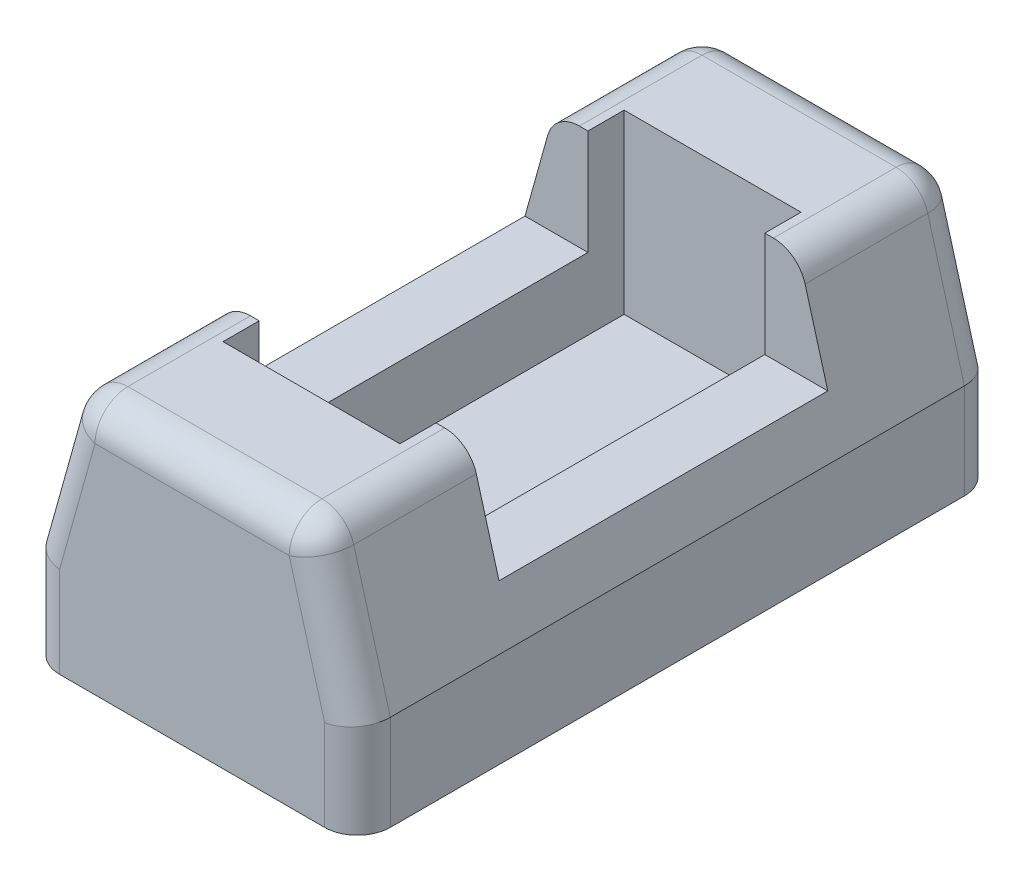
ISO-10303-21;
HEADER;
FILE_DESCRIPTION(('STEP AP214'),'2;1');
FILE_NAME('part.step','',(''),(''),'','','');
FILE_SCHEMA(('AUTOMOTIVE_DESIGN { 1 0 10303 214 1 1 1 1 }'));
ENDSEC;
DATA;
#1=APPLICATION_CONTEXT('core data for automotive mechanical design processes');
#2=APPLICATION_PROTOCOL_DEFINITION('international standard','automotive_design',2000,#1);
#3=PRODUCT_CONTEXT('',#1,'mechanical');
#4=PRODUCT('Part','Part','',(#3));
#5=PRODUCT_RELATED_PRODUCT_CATEGORY('part','',(#4));
#6=PRODUCT_DEFINITION_FORMATION('','',#4);
#7=PRODUCT_DEFINITION_CONTEXT('part definition',#1,'design');
#8=PRODUCT_DEFINITION('design','',#6,#7);
#9=PRODUCT_DEFINITION_SHAPE('','',#8);
#10=(LENGTH_UNIT() NAMED_UNIT(*) SI_UNIT(.MILLI.,.METRE.));
#11=(NAMED_UNIT(*) PLANE_ANGLE_UNIT() SI_UNIT($,.RADIAN.));
#12=(NAMED_UNIT(*) SI_UNIT($,.STERADIAN.) SOLID_ANGLE_UNIT());
#13=UNCERTAINTY_MEASURE_WITH_UNIT(LENGTH_MEASURE(1.E-05),#10,'distance_accuracy_value','');
#14=(GEOMETRIC_REPRESENTATION_CONTEXT(3) GLOBAL_UNCERTAINTY_ASSIGNED_CONTEXT((#13)) GLOBAL_UNIT_ASSIGNED_CONTEXT((#10,
#11,#12)) REPRESENTATION_CONTEXT('',''));
#15=CARTESIAN_POINT('',(0.,0.,0.));
#16=DIRECTION('',(0.,0.,1.));
#17=DIRECTION('',(1.,0.,0.));
#18=AXIS2_PLACEMENT_3D('',#15,#16,#17);
#19=CARTESIAN_POINT('',(0.,1.12,0.));
#20=DIRECTION('',(0.,1.,0.));
#21=DIRECTION('',(0.,0.,1.));
#22=AXIS2_PLACEMENT_3D('',#19,#20,#21);
#23=PLANE('',#22);
#24=DIRECTION('',(0.,0.,-1.));
#25=VECTOR('',#24,1.);
#26=CARTESIAN_POINT('',(1.345,1.12,3.05));
#27=LINE('',#26,#25);
#28=CARTESIAN_POINT('',(1.345,1.12,3.05));
#29=VERTEX_POINT('',#28);
#30=CARTESIAN_POINT('',(1.345,1.12,-3.05));
#31=VERTEX_POINT('',#30);
#32=EDGE_CURVE('E655',#29,#31,#27,.T.);
#33=ORIENTED_EDGE('',*,*,#32,.T.);
#34=DIRECTION('',(-1.,0.,0.));
#35=VECTOR('',#34,1.);
#36=CARTESIAN_POINT('',(1.345,1.12,-3.05));
#37=LINE('',#36,#35);
#38=CARTESIAN_POINT('',(-1.345,1.12,-3.05));
#39=VERTEX_POINT('',#38);
#40=EDGE_CURVE('E658',#31,#39,#37,.T.);
#41=ORIENTED_EDGE('',*,*,#40,.T.);
#42=DIRECTION('',(0.,0.,1.));
#43=VECTOR('',#42,1.);
#44=CARTESIAN_POINT('',(-1.345,1.12,3.05));
#45=LINE('',#44,#43);
#46=CARTESIAN_POINT('',(-1.345,1.12,3.05));
#47=VERTEX_POINT('',#46);
#48=EDGE_CURVE('E645',#39,#47,#45,.T.);
#49=ORIENTED_EDGE('',*,*,#48,.T.);
#50=DIRECTION('',(1.,0.,0.));
#51=VECTOR('',#50,1.);
#52=CARTESIAN_POINT('',(1.345,1.12,3.05));
#53=LINE('',#52,#51);
#54=EDGE_CURVE('E667',#47,#29,#53,.T.);
#55=ORIENTED_EDGE('',*,*,#54,.T.);
#56=EDGE_LOOP('',(#33,#41,#49,#55));
#57=FACE_BOUND('',#56,.T.);
#58=ADVANCED_FACE('F17',(#57),#23,.T.);
#59=CARTESIAN_POINT('',(1.345,1.12,-3.05));
#60=DIRECTION('',(0.,0.,-1.));
#61=DIRECTION('',(-1.,0.,0.));
#62=AXIS2_PLACEMENT_3D('',#59,#60,#61);
#63=PLANE('',#62);
#64=DIRECTION('',(0.,1.,0.));
#65=VECTOR('',#64,1.);
#66=CARTESIAN_POINT('',(-1.345,1.12,-3.05));
#67=LINE('',#66,#65);
#68=CARTESIAN_POINT('',(-1.345,3.81,-3.05));
#69=VERTEX_POINT('',#68);
#70=EDGE_CURVE('E628',#69,#39,#67,.F.);
#71=ORIENTED_EDGE('',*,*,#70,.T.);
#72=ORIENTED_EDGE('',*,*,#40,.F.);
#73=DIRECTION('',(0.,1.,0.));
#74=VECTOR('',#73,1.);
#75=CARTESIAN_POINT('',(1.345,1.12,-3.05));
#76=LINE('',#75,#74);
#77=CARTESIAN_POINT('',(1.345,3.81,-3.05));
#78=VERTEX_POINT('',#77);
#79=EDGE_CURVE('E652',#31,#78,#76,.T.);
#80=ORIENTED_EDGE('',*,*,#79,.T.);
#81=DIRECTION('',(1.,0.,0.));
#82=VECTOR('',#81,1.);
#83=CARTESIAN_POINT('',(-1.855543495359,3.81,-3.05));
#84=LINE('',#83,#82);
#85=EDGE_CURVE('E631',#78,#69,#84,.F.);
#86=ORIENTED_EDGE('',*,*,#85,.T.);
#87=EDGE_LOOP('',(#71,#72,#80,#86));
#88=FACE_BOUND('',#87,.T.);
#89=ADVANCED_FACE('F423',(#88),#63,.F.);
#90=CARTESIAN_POINT('',(-1.345,1.12,3.05));
#91=DIRECTION('',(-1.,0.,0.));
#92=DIRECTION('',(0.,0.,1.));
#93=AXIS2_PLACEMENT_3D('',#90,#91,#92);
#94=PLANE('',#93);
#95=DIRECTION('',(0.,1.,0.));
#96=VECTOR('',#95,1.);
#97=CARTESIAN_POINT('',(-1.345,1.12,3.05));
#98=LINE('',#97,#96);
#99=CARTESIAN_POINT('',(-1.345,3.81,3.05));
#100=VERTEX_POINT('',#99);
#101=EDGE_CURVE('E669',#100,#47,#98,.F.);
#102=ORIENTED_EDGE('',*,*,#101,.T.);
#103=ORIENTED_EDGE('',*,*,#48,.F.);
#104=ORIENTED_EDGE('',*,*,#70,.F.);
#105=DIRECTION('',(0.,0.,-1.));
#106=VECTOR('',#105,1.);
#107=CARTESIAN_POINT('',(-1.345,3.81,4.865));
#108=LINE('',#107,#106);
#109=CARTESIAN_POINT('',(-1.345,3.81,-2.5));
#110=VERTEX_POINT('',#109);
#111=EDGE_CURVE('E625',#69,#110,#108,.F.);
#112=ORIENTED_EDGE('',*,*,#111,.T.);
#113=DIRECTION('',(0.,1.,0.));
#114=VECTOR('',#113,1.);
#115=CARTESIAN_POINT('',(-1.345,3.81,-2.5));
#116=LINE('',#115,#114);
#117=CARTESIAN_POINT('',(-1.345,2.21,-2.5));
#118=VERTEX_POINT('',#117);
#119=EDGE_CURVE('E389',#110,#118,#116,.F.);
#120=ORIENTED_EDGE('',*,*,#119,.T.);
#121=DIRECTION('',(0.,0.,-1.));
#122=VECTOR('',#121,1.);
#123=CARTESIAN_POINT('',(-1.345,2.21,2.5));
#124=LINE('',#123,#122);
#125=CARTESIAN_POINT('',(-1.345,2.21,2.5));
#126=VERTEX_POINT('',#125);
#127=EDGE_CURVE('E367',#118,#126,#124,.F.);
#128=ORIENTED_EDGE('',*,*,#127,.T.);
#129=DIRECTION('',(0.,1.,0.));
#130=VECTOR('',#129,1.);
#131=CARTESIAN_POINT('',(-1.345,1.12,2.5));
#132=LINE('',#131,#130);
#133=CARTESIAN_POINT('',(-1.345,3.81,2.5));
#134=VERTEX_POINT('',#133);
#135=EDGE_CURVE('E617',#134,#126,#132,.F.);
#136=ORIENTED_EDGE('',*,*,#135,.F.);
#137=DIRECTION('',(0.,0.,1.));
#138=VECTOR('',#137,1.);
#139=CARTESIAN_POINT('',(-1.345,3.81,3.05));
#140=LINE('',#139,#138);
#141=EDGE_CURVE('E672',#100,#134,#140,.F.);
#142=ORIENTED_EDGE('',*,*,#141,.F.);
#143=EDGE_LOOP('',(#102,#103,#104,#112,#120,#128,#136,#142));
#144=FACE_BOUND('',#143,.T.);
#145=ADVANCED_FACE('F420',(#144),#94,.F.);
#146=CARTESIAN_POINT('',(1.345,1.12,3.05));
#147=DIRECTION('',(0.,0.,1.));
#148=DIRECTION('',(1.,0.,0.));
#149=AXIS2_PLACEMENT_3D('',#146,#147,#148);
#150=PLANE('',#149);
#151=DIRECTION('',(0.,1.,0.));
#152=VECTOR('',#151,1.);
#153=CARTESIAN_POINT('',(1.345,1.12,3.05));
#154=LINE('',#153,#152);
#155=CARTESIAN_POINT('',(1.345,3.81,3.05));
#156=VERTEX_POINT('',#155);
#157=EDGE_CURVE('E664',#156,#29,#154,.F.);
#158=ORIENTED_EDGE('',*,*,#157,.T.);
#159=ORIENTED_EDGE('',*,*,#54,.F.);
#160=ORIENTED_EDGE('',*,*,#101,.F.);
#161=DIRECTION('',(1.,0.,0.));
#162=VECTOR('',#161,1.);
#163=CARTESIAN_POINT('',(-1.855543495359,3.81,3.05));
#164=LINE('',#163,#162);
#165=EDGE_CURVE('E709',#100,#156,#164,.T.);
#166=ORIENTED_EDGE('',*,*,#165,.T.);
#167=EDGE_LOOP('',(#158,#159,#160,#166));
#168=FACE_BOUND('',#167,.T.);
#169=ADVANCED_FACE('F416',(#168),#150,.F.);
#170=CARTESIAN_POINT('',(1.345,1.12,3.05));
#171=DIRECTION('',(1.,0.,0.));
#172=DIRECTION('',(0.,0.,-1.));
#173=AXIS2_PLACEMENT_3D('',#170,#171,#172);
#174=PLANE('',#173);
#175=DIRECTION('',(0.,1.,0.));
#176=VECTOR('',#175,1.);
#177=CARTESIAN_POINT('',(1.345,1.12,-2.5));
#178=LINE('',#177,#176);
#179=CARTESIAN_POINT('',(1.345,3.81,-2.5));
#180=VERTEX_POINT('',#179);
#181=CARTESIAN_POINT('',(1.345,2.21,-2.5));
#182=VERTEX_POINT('',#181);
#183=EDGE_CURVE('E654',#180,#182,#178,.F.);
#184=ORIENTED_EDGE('',*,*,#183,.F.);
#185=DIRECTION('',(0.,0.,-1.));
#186=VECTOR('',#185,1.);
#187=CARTESIAN_POINT('',(1.345,3.81,4.865));
#188=LINE('',#187,#186);
#189=EDGE_CURVE('E649',#180,#78,#188,.T.);
#190=ORIENTED_EDGE('',*,*,#189,.T.);
#191=ORIENTED_EDGE('',*,*,#79,.F.);
#192=ORIENTED_EDGE('',*,*,#32,.F.);
#193=ORIENTED_EDGE('',*,*,#157,.F.);
#194=DIRECTION('',(0.,0.,-1.));
#195=VECTOR('',#194,1.);
#196=CARTESIAN_POINT('',(1.345,3.81,4.865));
#197=LINE('',#196,#195);
#198=CARTESIAN_POINT('',(1.345,3.81,2.5));
#199=VERTEX_POINT('',#198);
#200=EDGE_CURVE('E551',#156,#199,#197,.T.);
#201=ORIENTED_EDGE('',*,*,#200,.T.);
#202=DIRECTION('',(0.,-1.,0.));
#203=VECTOR('',#202,1.);
#204=CARTESIAN_POINT('',(1.345,3.81,2.5));
#205=LINE('',#204,#203);
#206=CARTESIAN_POINT('',(1.345,2.21,2.5));
#207=VERTEX_POINT('',#206);
#208=EDGE_CURVE('E312',#199,#207,#205,.T.);
#209=ORIENTED_EDGE('',*,*,#208,.T.);
#210=DIRECTION('',(0.,0.,-1.));
#211=VECTOR('',#210,1.);
#212=CARTESIAN_POINT('',(1.345,2.21,2.5));
#213=LINE('',#212,#211);
#214=EDGE_CURVE('E293',#207,#182,#213,.T.);
#215=ORIENTED_EDGE('',*,*,#214,.T.);
#216=EDGE_LOOP('',(#184,#190,#191,#192,#193,#201,#209,#215));
#217=FACE_BOUND('',#216,.T.);
#218=ADVANCED_FACE('F412',(#217),#174,.F.);
#219=CARTESIAN_POINT('',(-1.855543495359,3.81,4.865));
#220=DIRECTION('',(0.,-1.,0.));
#221=DIRECTION('',(0.,0.,-1.));
#222=AXIS2_PLACEMENT_3D('',#219,#220,#221);
#223=PLANE('',#222);
#224=DIRECTION('',(0.,0.,-1.));
#225=VECTOR('',#224,1.);
#226=CARTESIAN_POINT('',(1.476121261194,3.81,4.865));
#227=LINE('',#226,#225);
#228=CARTESIAN_POINT('',(1.476121261194,3.81,-4.365));
#229=VERTEX_POINT('',#228);
#230=CARTESIAN_POINT('',(1.476121261194,3.81,-2.5));
#231=VERTEX_POINT('',#230);
#232=EDGE_CURVE('E277',#229,#231,#227,.F.);
#233=ORIENTED_EDGE('',*,*,#232,.F.);
#234=DIRECTION('',(-1.,0.,0.));
#235=VECTOR('',#234,1.);
#236=CARTESIAN_POINT('',(-1.855543495359,3.81,-4.365));
#237=LINE('',#236,#235);
#238=CARTESIAN_POINT('',(-1.476121261194,3.81,-4.365));
#239=VERTEX_POINT('',#238);
#240=EDGE_CURVE('E248',#239,#229,#237,.F.);
#241=ORIENTED_EDGE('',*,*,#240,.F.);
#242=DIRECTION('',(0.,0.,-1.));
#243=VECTOR('',#242,1.);
#244=CARTESIAN_POINT('',(-1.476121261194,3.81,4.865));
#245=LINE('',#244,#243);
#246=CARTESIAN_POINT('',(-1.476121261194,3.81,-2.5));
#247=VERTEX_POINT('',#246);
#248=EDGE_CURVE('E390',#247,#239,#245,.T.);
#249=ORIENTED_EDGE('',*,*,#248,.F.);
#250=DIRECTION('',(1.,0.,0.));
#251=VECTOR('',#250,1.);
#252=CARTESIAN_POINT('',(-2.515,3.81,-2.5));
#253=LINE('',#252,#251);
#254=EDGE_CURVE('E375',#247,#110,#253,.T.);
#255=ORIENTED_EDGE('',*,*,#254,.T.);
#256=ORIENTED_EDGE('',*,*,#111,.F.);
#257=ORIENTED_EDGE('',*,*,#85,.F.);
#258=ORIENTED_EDGE('',*,*,#189,.F.);
#259=DIRECTION('',(1.,0.,0.));
#260=VECTOR('',#259,1.);
#261=CARTESIAN_POINT('',(-2.515,3.81,-2.5));
#262=LINE('',#261,#260);
#263=EDGE_CURVE('E286',#180,#231,#262,.T.);
#264=ORIENTED_EDGE('',*,*,#263,.T.);
#265=EDGE_LOOP('',(#233,#241,#249,#255,#256,#257,#258,#264));
#266=FACE_BOUND('',#265,.T.);
#267=ADVANCED_FACE('F408',(#266),#223,.F.);
#268=CARTESIAN_POINT('',(1.476121261194,3.31,-4.365));
#269=DIRECTION('',(1.,0.,0.));
#270=DIRECTION('',(0.,0.,-1.));
#271=AXIS2_PLACEMENT_3D('',#268,#269,#270);
#272=SPHERICAL_SURFACE('',#271,0.5);
#273=CARTESIAN_POINT('',(1.476121261194,3.31,-4.365));
#274=DIRECTION('',(-1.,0.,0.));
#275=DIRECTION('',(0.,0.,1.));
#276=AXIS2_PLACEMENT_3D('',#273,#274,#275);
#277=CIRCLE('',#276,0.5);
#278=CARTESIAN_POINT('',(1.47612126119402,3.31000000000001,-4.865));
#279=VERTEX_POINT('',#278);
#280=EDGE_CURVE('E252',#229,#279,#277,.T.);
#281=ORIENTED_EDGE('',*,*,#280,.F.);
#282=CARTESIAN_POINT('',(1.476121261194,3.31,-4.365));
#283=DIRECTION('',(0.,0.,-1.));
#284=DIRECTION('',(-1.,0.,0.));
#285=AXIS2_PLACEMENT_3D('',#282,#283,#284);
#286=CIRCLE('',#285,0.5);
#287=CARTESIAN_POINT('',(1.95766894096455,3.44458020696883,-4.365));
#288=VERTEX_POINT('',#287);
#289=EDGE_CURVE('E274',#288,#229,#286,.F.);
#290=ORIENTED_EDGE('',*,*,#289,.F.);
#291=CARTESIAN_POINT('',(1.47612126119442,3.31000000000012,-4.365));
#292=DIRECTION('',(-0.26916041393698,0.96309535954093,0.));
#293=DIRECTION('',(-0.96309535954093,-0.26916041393698,0.));
#294=AXIS2_PLACEMENT_3D('',#291,#292,#293);
#295=CIRCLE('',#294,0.5);
#296=EDGE_CURVE('E249',#279,#288,#295,.F.);
#297=ORIENTED_EDGE('',*,*,#296,.F.);
#298=EDGE_LOOP('',(#281,#290,#297));
#299=FACE_BOUND('',#298,.T.);
#300=ADVANCED_FACE('F403',(#299),#272,.T.);
#301=CARTESIAN_POINT('',(-1.476121261194,3.31,-4.365));
#302=DIRECTION('',(1.,0.,0.));
#303=DIRECTION('',(0.,0.,-1.));
#304=AXIS2_PLACEMENT_3D('',#301,#302,#303);
#305=SPHERICAL_SURFACE('',#304,0.5);
#306=CARTESIAN_POINT('',(-1.476121261194,3.31,-4.365));
#307=DIRECTION('',(0.,0.,-1.));
#308=DIRECTION('',(-1.,0.,0.));
#309=AXIS2_PLACEMENT_3D('',#306,#307,#308);
#310=CIRCLE('',#309,0.5);
#311=CARTESIAN_POINT('',(-1.95766894096455,3.44458020696883,-4.365));
#312=VERTEX_POINT('',#311);
#313=EDGE_CURVE('E387',#239,#312,#310,.F.);
#314=ORIENTED_EDGE('',*,*,#313,.F.);
#315=CARTESIAN_POINT('',(-1.476121261194,3.31,-4.365));
#316=DIRECTION('',(-1.,0.,0.));
#317=DIRECTION('',(0.,0.,1.));
#318=AXIS2_PLACEMENT_3D('',#315,#316,#317);
#319=CIRCLE('',#318,0.5);
#320=CARTESIAN_POINT('',(-1.476121261194,3.31000000000032,-4.865));
#321=VERTEX_POINT('',#320);
#322=EDGE_CURVE('E245',#321,#239,#319,.F.);
#323=ORIENTED_EDGE('',*,*,#322,.F.);
#324=CARTESIAN_POINT('',(-1.47612126119425,3.31000000000071,-4.365));
#325=DIRECTION('',(-0.26916041393698,-0.96309535954093,0.));
#326=DIRECTION('',(0.96309535954093,-0.26916041393698,0.));
#327=AXIS2_PLACEMENT_3D('',#324,#325,#326);
#328=CIRCLE('',#327,0.5);
#329=EDGE_CURVE('E254',#312,#321,#328,.T.);
#330=ORIENTED_EDGE('',*,*,#329,.F.);
#331=EDGE_LOOP('',(#314,#323,#330));
#332=FACE_BOUND('',#331,.T.);
#333=ADVANCED_FACE('F398',(#332),#305,.T.);
#334=CARTESIAN_POINT('',(-1.476121261194,3.31,4.865));
#335=DIRECTION('',(0.,0.,-1.));
#336=DIRECTION('',(-1.,0.,0.));
#337=AXIS2_PLACEMENT_3D('',#334,#335,#336);
#338=CYLINDRICAL_SURFACE('',#337,0.5);
#339=ORIENTED_EDGE('',*,*,#313,.T.);
#340=DIRECTION('',(0.,0.,1.));
#341=VECTOR('',#340,1.);
#342=CARTESIAN_POINT('',(-1.95766894096442,3.44458020696912,4.865));
#343=LINE('',#342,#341);
#344=CARTESIAN_POINT('',(-1.9576689409645,3.44458020696882,-2.5));
#345=VERTEX_POINT('',#344);
#346=EDGE_CURVE('E235',#312,#345,#343,.T.);
#347=ORIENTED_EDGE('',*,*,#346,.T.);
#348=CARTESIAN_POINT('',(-1.476121261194,3.31,-2.5));
#349=DIRECTION('',(0.,0.,-1.));
#350=DIRECTION('',(-1.,0.,0.));
#351=AXIS2_PLACEMENT_3D('',#348,#349,#350);
#352=CIRCLE('',#351,0.5);
#353=EDGE_CURVE('E20',#345,#247,#352,.T.);
#354=ORIENTED_EDGE('',*,*,#353,.T.);
#355=ORIENTED_EDGE('',*,*,#248,.T.);
#356=EDGE_LOOP('',(#339,#347,#354,#355));
#357=FACE_BOUND('',#356,.T.);
#358=ADVANCED_FACE('F402',(#357),#338,.T.);
#359=CARTESIAN_POINT('',(-2.515,3.81,-2.5));
#360=DIRECTION('',(0.,0.,-1.));
#361=DIRECTION('',(0.,1.,0.));
#362=AXIS2_PLACEMENT_3D('',#359,#360,#361);
#363=PLANE('',#362);
#364=ORIENTED_EDGE('',*,*,#353,.F.);
#365=DIRECTION('',(0.26916041393698,0.96309535954093,0.));
#366=VECTOR('',#365,1.);
#367=CARTESIAN_POINT('',(-2.515,1.45036809816,-2.5));
#368=LINE('',#367,#366);
#369=CARTESIAN_POINT('',(-2.30270239611944,2.21000000000008,-2.5));
#370=VERTEX_POINT('',#369);
#371=EDGE_CURVE('E371',#345,#370,#368,.F.);
#372=ORIENTED_EDGE('',*,*,#371,.T.);
#373=DIRECTION('',(1.,0.,0.));
#374=VECTOR('',#373,1.);
#375=CARTESIAN_POINT('',(-2.515,2.21,-2.5));
#376=LINE('',#375,#374);
#377=EDGE_CURVE('E142',#370,#118,#376,.T.);
#378=ORIENTED_EDGE('',*,*,#377,.T.);
#379=ORIENTED_EDGE('',*,*,#119,.F.);
#380=ORIENTED_EDGE('',*,*,#254,.F.);
#381=EDGE_LOOP('',(#364,#372,#378,#379,#380));
#382=FACE_BOUND('',#381,.T.);
#383=ADVANCED_FACE('F621',(#382),#363,.F.);
#384=CARTESIAN_POINT('',(-2.515,2.21,2.5));
#385=DIRECTION('',(0.,-1.,0.));
#386=DIRECTION('',(0.,0.,-1.));
#387=AXIS2_PLACEMENT_3D('',#384,#385,#386);
#388=PLANE('',#387);
#389=ORIENTED_EDGE('',*,*,#127,.F.);
#390=ORIENTED_EDGE('',*,*,#377,.F.);
#391=DIRECTION('',(0.,0.,1.));
#392=VECTOR('',#391,1.);
#393=CARTESIAN_POINT('',(-2.30270239611944,2.21000000000012,4.865));
#394=LINE('',#393,#392);
#395=CARTESIAN_POINT('',(-2.30270239611944,2.21000000000008,2.5));
#396=VERTEX_POINT('',#395);
#397=EDGE_CURVE('E361',#370,#396,#394,.T.);
#398=ORIENTED_EDGE('',*,*,#397,.T.);
#399=DIRECTION('',(1.,0.,0.));
#400=VECTOR('',#399,1.);
#401=CARTESIAN_POINT('',(-2.515,2.21,2.5));
#402=LINE('',#401,#400);
#403=EDGE_CURVE('E364',#396,#126,#402,.T.);
#404=ORIENTED_EDGE('',*,*,#403,.T.);
#405=EDGE_LOOP('',(#389,#390,#398,#404));
#406=FACE_BOUND('',#405,.T.);
#407=ADVANCED_FACE('F619',(#406),#388,.F.);
#408=CARTESIAN_POINT('',(-2.515,3.81,2.5));
#409=DIRECTION('',(0.,0.,1.));
#410=DIRECTION('',(0.,-1.,0.));
#411=AXIS2_PLACEMENT_3D('',#408,#409,#410);
#412=PLANE('',#411);
#413=CARTESIAN_POINT('',(-1.476121261194,3.31,2.5));
#414=DIRECTION('',(0.,0.,-1.));
#415=DIRECTION('',(-1.,0.,0.));
#416=AXIS2_PLACEMENT_3D('',#413,#414,#415);
#417=CIRCLE('',#416,0.5);
#418=CARTESIAN_POINT('',(-1.476121261194,3.81,2.5));
#419=VERTEX_POINT('',#418);
#420=CARTESIAN_POINT('',(-1.9576689409645,3.44458020696882,2.5));
#421=VERTEX_POINT('',#420);
#422=EDGE_CURVE('E356',#419,#421,#417,.F.);
#423=ORIENTED_EDGE('',*,*,#422,.F.);
#424=DIRECTION('',(1.,0.,0.));
#425=VECTOR('',#424,1.);
#426=CARTESIAN_POINT('',(-1.855543495359,3.81,2.5));
#427=LINE('',#426,#425);
#428=EDGE_CURVE('E355',#419,#134,#427,.T.);
#429=ORIENTED_EDGE('',*,*,#428,.T.);
#430=ORIENTED_EDGE('',*,*,#135,.T.);
#431=ORIENTED_EDGE('',*,*,#403,.F.);
#432=DIRECTION('',(0.26916041393698,0.96309535954093,0.));
#433=VECTOR('',#432,1.);
#434=CARTESIAN_POINT('',(-2.515,1.45036809816,2.5));
#435=LINE('',#434,#433);
#436=EDGE_CURVE('E318',#396,#421,#435,.T.);
#437=ORIENTED_EDGE('',*,*,#436,.T.);
#438=EDGE_LOOP('',(#423,#429,#430,#431,#437));
#439=FACE_BOUND('',#438,.T.);
#440=ADVANCED_FACE('F616',(#439),#412,.F.);
#441=CARTESIAN_POINT('',(-1.476121261194,3.31,4.865));
#442=DIRECTION('',(0.,0.,-1.));
#443=DIRECTION('',(-1.,0.,0.));
#444=AXIS2_PLACEMENT_3D('',#441,#442,#443);
#445=CYLINDRICAL_SURFACE('',#444,0.5);
#446=CARTESIAN_POINT('',(-1.476121261194,3.31,4.365));
#447=DIRECTION('',(0.,0.,1.));
#448=DIRECTION('',(1.,0.,0.));
#449=AXIS2_PLACEMENT_3D('',#446,#447,#448);
#450=CIRCLE('',#449,0.5);
#451=CARTESIAN_POINT('',(-1.476121261194,3.81,4.365));
#452=VERTEX_POINT('',#451);
#453=CARTESIAN_POINT('',(-1.95766894096446,3.44458020696881,4.365));
#454=VERTEX_POINT('',#453);
#455=EDGE_CURVE('E321',#452,#454,#450,.T.);
#456=ORIENTED_EDGE('',*,*,#455,.F.);
#457=DIRECTION('',(0.,0.,-1.));
#458=VECTOR('',#457,1.);
#459=CARTESIAN_POINT('',(-1.476121261194,3.81,4.865));
#460=LINE('',#459,#458);
#461=EDGE_CURVE('E352',#452,#419,#460,.T.);
#462=ORIENTED_EDGE('',*,*,#461,.T.);
#463=ORIENTED_EDGE('',*,*,#422,.T.);
#464=DIRECTION('',(0.,0.,1.));
#465=VECTOR('',#464,1.);
#466=CARTESIAN_POINT('',(-1.95766894096442,3.44458020696912,4.865));
#467=LINE('',#466,#465);
#468=EDGE_CURVE('E315',#421,#454,#467,.T.);
#469=ORIENTED_EDGE('',*,*,#468,.T.);
#470=EDGE_LOOP('',(#456,#462,#463,#469));
#471=FACE_BOUND('',#470,.T.);
#472=ADVANCED_FACE('F339',(#471),#445,.T.);
#473=CARTESIAN_POINT('',(1.476121261194,3.31,4.365));
#474=DIRECTION('',(1.,0.,0.));
#475=DIRECTION('',(0.,0.,-1.));
#476=AXIS2_PLACEMENT_3D('',#473,#474,#475);
#477=SPHERICAL_SURFACE('',#476,0.5);
#478=CARTESIAN_POINT('',(1.476121261194,3.31,4.365));
#479=DIRECTION('',(1.,0.,0.));
#480=DIRECTION('',(0.,0.,-1.));
#481=AXIS2_PLACEMENT_3D('',#478,#479,#480);
#482=CIRCLE('',#481,0.5);
#483=CARTESIAN_POINT('',(1.476121261194,3.31000000000032,4.865));
#484=VERTEX_POINT('',#483);
#485=CARTESIAN_POINT('',(1.476121261194,3.81,4.365));
#486=VERTEX_POINT('',#485);
#487=EDGE_CURVE('E349',#484,#486,#482,.F.);
#488=ORIENTED_EDGE('',*,*,#487,.F.);
#489=CARTESIAN_POINT('',(1.4761212611939,3.31000000000061,4.365));
#490=DIRECTION('',(0.26916041393698,-0.96309535954093,0.));
#491=DIRECTION('',(0.96309535954093,0.26916041393698,0.));
#492=AXIS2_PLACEMENT_3D('',#489,#490,#491);
#493=CIRCLE('',#492,0.5);
#494=CARTESIAN_POINT('',(1.95766894096446,3.44458020696881,4.365));
#495=VERTEX_POINT('',#494);
#496=EDGE_CURVE('E219',#495,#484,#493,.T.);
#497=ORIENTED_EDGE('',*,*,#496,.F.);
#498=CARTESIAN_POINT('',(1.476121261194,3.31,4.365));
#499=DIRECTION('',(0.,0.,-1.));
#500=DIRECTION('',(-1.,0.,0.));
#501=AXIS2_PLACEMENT_3D('',#498,#499,#500);
#502=CIRCLE('',#501,0.5);
#503=EDGE_CURVE('E264',#486,#495,#502,.T.);
#504=ORIENTED_EDGE('',*,*,#503,.F.);
#505=EDGE_LOOP('',(#488,#497,#504));
#506=FACE_BOUND('',#505,.T.);
#507=ADVANCED_FACE('F334',(#506),#477,.T.);
#508=CARTESIAN_POINT('',(-1.855543495359,3.81,4.865));
#509=DIRECTION('',(0.,-1.,0.));
#510=DIRECTION('',(0.,0.,-1.));
#511=AXIS2_PLACEMENT_3D('',#508,#509,#510);
#512=PLANE('',#511);
#513=DIRECTION('',(0.,0.,-1.));
#514=VECTOR('',#513,1.);
#515=CARTESIAN_POINT('',(1.476121261194,3.81,4.865));
#516=LINE('',#515,#514);
#517=CARTESIAN_POINT('',(1.476121261194,3.81,2.5));
#518=VERTEX_POINT('',#517);
#519=EDGE_CURVE('E266',#518,#486,#516,.F.);
#520=ORIENTED_EDGE('',*,*,#519,.F.);
#521=DIRECTION('',(1.,0.,0.));
#522=VECTOR('',#521,1.);
#523=CARTESIAN_POINT('',(-2.515,3.81,2.5));
#524=LINE('',#523,#522);
#525=EDGE_CURVE('E303',#518,#199,#524,.F.);
#526=ORIENTED_EDGE('',*,*,#525,.T.);
#527=ORIENTED_EDGE('',*,*,#200,.F.);
#528=ORIENTED_EDGE('',*,*,#165,.F.);
#529=ORIENTED_EDGE('',*,*,#141,.T.);
#530=ORIENTED_EDGE('',*,*,#428,.F.);
#531=ORIENTED_EDGE('',*,*,#461,.F.);
#532=DIRECTION('',(1.,0.,0.));
#533=VECTOR('',#532,1.);
#534=CARTESIAN_POINT('',(0.,3.81,4.365));
#535=LINE('',#534,#533);
#536=EDGE_CURVE('E345',#486,#452,#535,.F.);
#537=ORIENTED_EDGE('',*,*,#536,.F.);
#538=EDGE_LOOP('',(#520,#526,#527,#528,#529,#530,#531,#537));
#539=FACE_BOUND('',#538,.T.);
#540=ADVANCED_FACE('F329',(#539),#512,.F.);
#541=CARTESIAN_POINT('',(-1.476121261194,3.31,4.365));
#542=DIRECTION('',(1.,0.,0.));
#543=DIRECTION('',(0.,0.,-1.));
#544=AXIS2_PLACEMENT_3D('',#541,#542,#543);
#545=SPHERICAL_SURFACE('',#544,0.5);
#546=CARTESIAN_POINT('',(-1.47612126119406,3.31000000000002,4.365));
#547=DIRECTION('',(0.26916041393698,0.96309535954093,0.));
#548=DIRECTION('',(-0.96309535954093,0.26916041393698,0.));
#549=AXIS2_PLACEMENT_3D('',#546,#547,#548);
#550=CIRCLE('',#549,0.5);
#551=CARTESIAN_POINT('',(-1.476121261194,3.31,4.865));
#552=VERTEX_POINT('',#551);
#553=EDGE_CURVE('E348',#552,#454,#550,.F.);
#554=ORIENTED_EDGE('',*,*,#553,.F.);
#555=CARTESIAN_POINT('',(-1.476121261194,3.31,4.365));
#556=DIRECTION('',(1.,0.,0.));
#557=DIRECTION('',(0.,0.,-1.));
#558=AXIS2_PLACEMENT_3D('',#555,#556,#557);
#559=CIRCLE('',#558,0.5);
#560=EDGE_CURVE('E553',#452,#552,#559,.T.);
#561=ORIENTED_EDGE('',*,*,#560,.F.);
#562=ORIENTED_EDGE('',*,*,#455,.T.);
#563=EDGE_LOOP('',(#554,#561,#562));
#564=FACE_BOUND('',#563,.T.);
#565=ADVANCED_FACE('F324',(#564),#545,.T.);
#566=CARTESIAN_POINT('',(-2.515,3.81,2.5));
#567=DIRECTION('',(0.,0.,1.));
#568=DIRECTION('',(0.,-1.,0.));
#569=AXIS2_PLACEMENT_3D('',#566,#567,#568);
#570=PLANE('',#569);
#571=CARTESIAN_POINT('',(1.476121261194,3.31,2.5));
#572=DIRECTION('',(0.,0.,-1.));
#573=DIRECTION('',(-1.,0.,0.));
#574=AXIS2_PLACEMENT_3D('',#571,#572,#573);
#575=CIRCLE('',#574,0.5);
#576=CARTESIAN_POINT('',(1.9576689409645,3.44458020696882,2.5));
#577=VERTEX_POINT('',#576);
#578=EDGE_CURVE('E528',#577,#518,#575,.F.);
#579=ORIENTED_EDGE('',*,*,#578,.F.);
#580=DIRECTION('',(0.26916041393698,-0.96309535954093,0.));
#581=VECTOR('',#580,1.);
#582=CARTESIAN_POINT('',(2.515,1.45036809816,2.5));
#583=LINE('',#582,#581);
#584=CARTESIAN_POINT('',(2.30270239611944,2.21000000000008,2.5));
#585=VERTEX_POINT('',#584);
#586=EDGE_CURVE('E205',#577,#585,#583,.T.);
#587=ORIENTED_EDGE('',*,*,#586,.T.);
#588=DIRECTION('',(1.,0.,0.));
#589=VECTOR('',#588,1.);
#590=CARTESIAN_POINT('',(-2.515,2.21,2.5));
#591=LINE('',#590,#589);
#592=EDGE_CURVE('E300',#585,#207,#591,.F.);
#593=ORIENTED_EDGE('',*,*,#592,.T.);
#594=ORIENTED_EDGE('',*,*,#208,.F.);
#595=ORIENTED_EDGE('',*,*,#525,.F.);
#596=EDGE_LOOP('',(#579,#587,#593,#594,#595));
#597=FACE_BOUND('',#596,.T.);
#598=ADVANCED_FACE('F328',(#597),#570,.F.);
#599=CARTESIAN_POINT('',(-2.515,2.21,2.5));
#600=DIRECTION('',(0.,-1.,0.));
#601=DIRECTION('',(0.,0.,-1.));
#602=AXIS2_PLACEMENT_3D('',#599,#600,#601);
#603=PLANE('',#602);
#604=ORIENTED_EDGE('',*,*,#214,.F.);
#605=ORIENTED_EDGE('',*,*,#592,.F.);
#606=DIRECTION('',(0.,0.,1.));
#607=VECTOR('',#606,1.);
#608=CARTESIAN_POINT('',(2.30270239611944,2.21000000000012,4.865));
#609=LINE('',#608,#607);
#610=CARTESIAN_POINT('',(2.30270239611944,2.21000000000008,-2.5));
#611=VERTEX_POINT('',#610);
#612=EDGE_CURVE('E283',#585,#611,#609,.F.);
#613=ORIENTED_EDGE('',*,*,#612,.T.);
#614=DIRECTION('',(1.,0.,0.));
#615=VECTOR('',#614,1.);
#616=CARTESIAN_POINT('',(-2.515,2.21,-2.5));
#617=LINE('',#616,#615);
#618=EDGE_CURVE('E288',#611,#182,#617,.F.);
#619=ORIENTED_EDGE('',*,*,#618,.T.);
#620=EDGE_LOOP('',(#604,#605,#613,#619));
#621=FACE_BOUND('',#620,.T.);
#622=ADVANCED_FACE('F508',(#621),#603,.F.);
#623=CARTESIAN_POINT('',(-2.515,3.81,-2.5));
#624=DIRECTION('',(0.,0.,-1.));
#625=DIRECTION('',(0.,1.,0.));
#626=AXIS2_PLACEMENT_3D('',#623,#624,#625);
#627=PLANE('',#626);
#628=CARTESIAN_POINT('',(1.476121261194,3.31,-2.5));
#629=DIRECTION('',(0.,0.,-1.));
#630=DIRECTION('',(-1.,0.,0.));
#631=AXIS2_PLACEMENT_3D('',#628,#629,#630);
#632=CIRCLE('',#631,0.5);
#633=CARTESIAN_POINT('',(1.9576689409645,3.44458020696882,-2.5));
#634=VERTEX_POINT('',#633);
#635=EDGE_CURVE('E278',#231,#634,#632,.T.);
#636=ORIENTED_EDGE('',*,*,#635,.F.);
#637=ORIENTED_EDGE('',*,*,#263,.F.);
#638=ORIENTED_EDGE('',*,*,#183,.T.);
#639=ORIENTED_EDGE('',*,*,#618,.F.);
#640=DIRECTION('',(0.26916041393698,-0.96309535954093,0.));
#641=VECTOR('',#640,1.);
#642=CARTESIAN_POINT('',(2.515,1.45036809816,-2.5));
#643=LINE('',#642,#641);
#644=EDGE_CURVE('E273',#611,#634,#643,.F.);
#645=ORIENTED_EDGE('',*,*,#644,.T.);
#646=EDGE_LOOP('',(#636,#637,#638,#639,#645));
#647=FACE_BOUND('',#646,.T.);
#648=ADVANCED_FACE('F505',(#647),#627,.F.);
#649=CARTESIAN_POINT('',(1.476121261194,3.31,4.865));
#650=DIRECTION('',(0.,0.,-1.));
#651=DIRECTION('',(-1.,0.,0.));
#652=AXIS2_PLACEMENT_3D('',#649,#650,#651);
#653=CYLINDRICAL_SURFACE('',#652,0.5);
#654=ORIENTED_EDGE('',*,*,#289,.T.);
#655=ORIENTED_EDGE('',*,*,#232,.T.);
#656=ORIENTED_EDGE('',*,*,#635,.T.);
#657=DIRECTION('',(0.,0.,1.));
#658=VECTOR('',#657,1.);
#659=CARTESIAN_POINT('',(1.95766894096442,3.44458020696912,4.865));
#660=LINE('',#659,#658);
#661=EDGE_CURVE('E269',#634,#288,#660,.F.);
#662=ORIENTED_EDGE('',*,*,#661,.T.);
#663=EDGE_LOOP('',(#654,#655,#656,#662));
#664=FACE_BOUND('',#663,.T.);
#665=ADVANCED_FACE('F501',(#664),#653,.T.);
#666=CARTESIAN_POINT('',(1.476121261194,3.31,4.865));
#667=DIRECTION('',(0.,0.,-1.));
#668=DIRECTION('',(-1.,0.,0.));
#669=AXIS2_PLACEMENT_3D('',#666,#667,#668);
#670=CYLINDRICAL_SURFACE('',#669,0.5);
#671=ORIENTED_EDGE('',*,*,#503,.T.);
#672=DIRECTION('',(0.,0.,1.));
#673=VECTOR('',#672,1.);
#674=CARTESIAN_POINT('',(1.95766894096442,3.44458020696912,4.865));
#675=LINE('',#674,#673);
#676=EDGE_CURVE('E260',#495,#577,#675,.F.);
#677=ORIENTED_EDGE('',*,*,#676,.T.);
#678=ORIENTED_EDGE('',*,*,#578,.T.);
#679=ORIENTED_EDGE('',*,*,#519,.T.);
#680=EDGE_LOOP('',(#671,#677,#678,#679));
#681=FACE_BOUND('',#680,.T.);
#682=ADVANCED_FACE('F497',(#681),#670,.T.);
#683=CARTESIAN_POINT('',(2.03345232023,1.315787891191,-4.365));
#684=DIRECTION('',(-0.26916041393698,0.96309535954093,0.));
#685=DIRECTION('',(-0.96309535954093,-0.26916041393698,0.));
#686=AXIS2_PLACEMENT_3D('',#683,#684,#685);
#687=CYLINDRICAL_SURFACE('',#686,0.5);
#688=ORIENTED_EDGE('',*,*,#296,.T.);
#689=DIRECTION('',(0.26916041393698,-0.96309535954093,0.));
#690=VECTOR('',#689,1.);
#691=CARTESIAN_POINT('',(2.515,1.45036809816,-4.365));
#692=LINE('',#691,#690);
#693=CARTESIAN_POINT('',(2.51499999999985,1.45036809816055,-4.365));
#694=VERTEX_POINT('',#693);
#695=EDGE_CURVE('E272',#288,#694,#692,.T.);
#696=ORIENTED_EDGE('',*,*,#695,.T.);
#697=CARTESIAN_POINT('',(2.015,1.38181299394046,-4.365));
#698=DIRECTION('',(-0.135839317686504,0.990730881607344,0.));
#699=DIRECTION('',(0.990730881607344,0.135839317686504,0.));
#700=AXIS2_PLACEMENT_3D('',#697,#698,#699);
#701=ELLIPSE('',#700,0.504677919384938,0.5);
#702=CARTESIAN_POINT('',(2.0149999999998,1.3818129939397,-4.865));
#703=VERTEX_POINT('',#702);
#704=EDGE_CURVE('E604',#703,#694,#701,.F.);
#705=ORIENTED_EDGE('',*,*,#704,.F.);
#706=DIRECTION('',(-0.269160413937001,0.963095359540924,0.));
#707=VECTOR('',#706,1.);
#708=CARTESIAN_POINT('',(2.015,1.381812993939,-4.865));
#709=LINE('',#708,#707);
#710=EDGE_CURVE('E244',#703,#279,#709,.T.);
#711=ORIENTED_EDGE('',*,*,#710,.T.);
#712=EDGE_LOOP('',(#688,#696,#705,#711));
#713=FACE_BOUND('',#712,.T.);
#714=ADVANCED_FACE('F493',(#713),#687,.T.);
#715=CARTESIAN_POINT('',(-1.855543495359,3.31,-4.365));
#716=DIRECTION('',(-1.,0.,0.));
#717=DIRECTION('',(0.,0.,1.));
#718=AXIS2_PLACEMENT_3D('',#715,#716,#717);
#719=CYLINDRICAL_SURFACE('',#718,0.5);
#720=ORIENTED_EDGE('',*,*,#280,.T.);
#721=DIRECTION('',(1.,0.,0.));
#722=VECTOR('',#721,1.);
#723=CARTESIAN_POINT('',(0.,3.31,-4.865));
#724=LINE('',#723,#722);
#725=EDGE_CURVE('E241',#279,#321,#724,.F.);
#726=ORIENTED_EDGE('',*,*,#725,.T.);
#727=ORIENTED_EDGE('',*,*,#322,.T.);
#728=ORIENTED_EDGE('',*,*,#240,.T.);
#729=EDGE_LOOP('',(#720,#726,#727,#728));
#730=FACE_BOUND('',#729,.T.);
#731=ADVANCED_FACE('F489',(#730),#719,.T.);
#732=CARTESIAN_POINT('',(-2.03345232023,1.315787891191,-4.365));
#733=DIRECTION('',(-0.26916041393698,-0.96309535954093,0.));
#734=DIRECTION('',(0.96309535954093,-0.26916041393698,0.));
#735=AXIS2_PLACEMENT_3D('',#732,#733,#734);
#736=CYLINDRICAL_SURFACE('',#735,0.5);
#737=ORIENTED_EDGE('',*,*,#329,.T.);
#738=DIRECTION('',(-0.269160413937001,-0.963095359540924,0.));
#739=VECTOR('',#738,1.);
#740=CARTESIAN_POINT('',(-1.476121261194,3.31,-4.865));
#741=LINE('',#740,#739);
#742=CARTESIAN_POINT('',(-2.0149999999998,1.3818129939397,-4.865));
#743=VERTEX_POINT('',#742);
#744=EDGE_CURVE('E237',#321,#743,#741,.T.);
#745=ORIENTED_EDGE('',*,*,#744,.T.);
#746=CARTESIAN_POINT('',(-2.015,1.38181299394046,-4.365));
#747=DIRECTION('',(-0.135839317686504,-0.990730881607344,0.));
#748=DIRECTION('',(0.990730881607344,-0.135839317686504,0.));
#749=AXIS2_PLACEMENT_3D('',#746,#747,#748);
#750=ELLIPSE('',#749,0.504677919384938,0.5);
#751=CARTESIAN_POINT('',(-2.51499999999985,1.45036809816055,-4.365));
#752=VERTEX_POINT('',#751);
#753=EDGE_CURVE('E236',#752,#743,#750,.T.);
#754=ORIENTED_EDGE('',*,*,#753,.F.);
#755=DIRECTION('',(0.26916041393698,0.96309535954093,0.));
#756=VECTOR('',#755,1.);
#757=CARTESIAN_POINT('',(-2.515,1.45036809816,-4.365));
#758=LINE('',#757,#756);
#759=EDGE_CURVE('E232',#752,#312,#758,.T.);
#760=ORIENTED_EDGE('',*,*,#759,.T.);
#761=EDGE_LOOP('',(#737,#745,#754,#760));
#762=FACE_BOUND('',#761,.T.);
#763=ADVANCED_FACE('F485',(#762),#736,.T.);
#764=CARTESIAN_POINT('',(-2.015,0.,-4.365));
#765=DIRECTION('',(0.,-1.,0.));
#766=DIRECTION('',(0.,0.,-1.));
#767=AXIS2_PLACEMENT_3D('',#764,#765,#766);
#768=CYLINDRICAL_SURFACE('',#767,0.5);
#769=ORIENTED_EDGE('',*,*,#753,.T.);
#770=DIRECTION('',(0.,1.,0.));
#771=VECTOR('',#770,1.);
#772=CARTESIAN_POINT('',(-2.015,0.,-4.865));
#773=LINE('',#772,#771);
#774=CARTESIAN_POINT('',(-2.015,0.,-4.865));
#775=VERTEX_POINT('',#774);
#776=EDGE_CURVE('E240',#743,#775,#773,.F.);
#777=ORIENTED_EDGE('',*,*,#776,.T.);
#778=CARTESIAN_POINT('',(-2.015,0.,-4.365));
#779=DIRECTION('',(0.,-1.,0.));
#780=DIRECTION('',(0.,0.,-1.));
#781=AXIS2_PLACEMENT_3D('',#778,#779,#780);
#782=CIRCLE('',#781,0.5);
#783=CARTESIAN_POINT('',(-2.515,0.,-4.365));
#784=VERTEX_POINT('',#783);
#785=EDGE_CURVE('E596',#775,#784,#782,.F.);
#786=ORIENTED_EDGE('',*,*,#785,.T.);
#787=DIRECTION('',(0.,1.,0.));
#788=VECTOR('',#787,1.);
#789=CARTESIAN_POINT('',(-2.515,0.,-4.365));
#790=LINE('',#789,#788);
#791=EDGE_CURVE('E231',#784,#752,#790,.T.);
#792=ORIENTED_EDGE('',*,*,#791,.T.);
#793=EDGE_LOOP('',(#769,#777,#786,#792));
#794=FACE_BOUND('',#793,.T.);
#795=ADVANCED_FACE('F481',(#794),#768,.T.);
#796=CARTESIAN_POINT('',(-2.515,1.45036809816,4.865));
#797=DIRECTION('',(0.96309535954093,-0.26916041393698,0.));
#798=DIRECTION('',(0.26916041393698,0.96309535954093,0.));
#799=AXIS2_PLACEMENT_3D('',#796,#797,#798);
#800=PLANE('',#799);
#801=ORIENTED_EDGE('',*,*,#468,.F.);
#802=ORIENTED_EDGE('',*,*,#436,.F.);
#803=ORIENTED_EDGE('',*,*,#397,.F.);
#804=ORIENTED_EDGE('',*,*,#371,.F.);
#805=ORIENTED_EDGE('',*,*,#346,.F.);
#806=ORIENTED_EDGE('',*,*,#759,.F.);
#807=DIRECTION('',(0.,0.,-1.));
#808=VECTOR('',#807,1.);
#809=CARTESIAN_POINT('',(-2.515,1.45036809816,4.865));
#810=LINE('',#809,#808);
#811=CARTESIAN_POINT('',(-2.515,1.45036809815989,4.365));
#812=VERTEX_POINT('',#811);
#813=EDGE_CURVE('E228',#752,#812,#810,.F.);
#814=ORIENTED_EDGE('',*,*,#813,.T.);
#815=DIRECTION('',(0.26916041393698,0.96309535954093,0.));
#816=VECTOR('',#815,1.);
#817=CARTESIAN_POINT('',(-2.70876975120246,0.75703156522449,4.365));
#818=LINE('',#817,#816);
#819=EDGE_CURVE('E561',#454,#812,#818,.F.);
#820=ORIENTED_EDGE('',*,*,#819,.F.);
#821=EDGE_LOOP('',(#801,#802,#803,#804,#805,#806,#814,#820));
#822=FACE_BOUND('',#821,.T.);
#823=ADVANCED_FACE('F478',(#822),#800,.F.);
#824=CARTESIAN_POINT('',(2.227222071432,0.622451358256,4.365));
#825=DIRECTION('',(0.26916041393698,-0.96309535954093,0.));
#826=DIRECTION('',(0.96309535954093,0.26916041393698,0.));
#827=AXIS2_PLACEMENT_3D('',#824,#825,#826);
#828=CYLINDRICAL_SURFACE('',#827,0.5);
#829=CARTESIAN_POINT('',(2.015,1.38181299393909,4.365));
#830=DIRECTION('',(0.135839317686504,-0.990730881607344,0.));
#831=DIRECTION('',(-0.990730881607344,-0.135839317686504,0.));
#832=AXIS2_PLACEMENT_3D('',#829,#830,#831);
#833=ELLIPSE('',#832,0.504677919384938,0.5);
#834=CARTESIAN_POINT('',(2.51500000000003,1.4503680981599,4.365));
#835=VERTEX_POINT('',#834);
#836=CARTESIAN_POINT('',(2.01499999999999,1.38181299393904,4.865));
#837=VERTEX_POINT('',#836);
#838=EDGE_CURVE('E195',#835,#837,#833,.T.);
#839=ORIENTED_EDGE('',*,*,#838,.F.);
#840=DIRECTION('',(0.26916041393698,-0.96309535954093,0.));
#841=VECTOR('',#840,1.);
#842=CARTESIAN_POINT('',(2.515,1.45036809816,4.365));
#843=LINE('',#842,#841);
#844=EDGE_CURVE('E263',#835,#495,#843,.F.);
#845=ORIENTED_EDGE('',*,*,#844,.T.);
#846=ORIENTED_EDGE('',*,*,#496,.T.);
#847=DIRECTION('',(-0.269160413937001,0.963095359540924,0.));
#848=VECTOR('',#847,1.);
#849=CARTESIAN_POINT('',(2.015,1.381812993939,4.865));
#850=LINE('',#849,#848);
#851=EDGE_CURVE('E211',#837,#484,#850,.T.);
#852=ORIENTED_EDGE('',*,*,#851,.F.);
#853=EDGE_LOOP('',(#839,#845,#846,#852));
#854=FACE_BOUND('',#853,.T.);
#855=ADVANCED_FACE('F217',(#854),#828,.T.);
#856=CARTESIAN_POINT('',(0.,3.31,4.365));
#857=DIRECTION('',(1.,0.,0.));
#858=DIRECTION('',(0.,0.,-1.));
#859=AXIS2_PLACEMENT_3D('',#856,#857,#858);
#860=CYLINDRICAL_SURFACE('',#859,0.5);
#861=ORIENTED_EDGE('',*,*,#487,.T.);
#862=ORIENTED_EDGE('',*,*,#536,.T.);
#863=ORIENTED_EDGE('',*,*,#560,.T.);
#864=DIRECTION('',(1.,0.,0.));
#865=VECTOR('',#864,1.);
#866=CARTESIAN_POINT('',(0.,3.31,4.865));
#867=LINE('',#866,#865);
#868=EDGE_CURVE('E220',#484,#552,#867,.F.);
#869=ORIENTED_EDGE('',*,*,#868,.F.);
#870=EDGE_LOOP('',(#861,#862,#863,#869));
#871=FACE_BOUND('',#870,.T.);
#872=ADVANCED_FACE('F471',(#871),#860,.T.);
#873=CARTESIAN_POINT('',(-2.227222071432,0.622451358256,4.365));
#874=DIRECTION('',(0.26916041393698,0.96309535954093,0.));
#875=DIRECTION('',(-0.96309535954093,0.26916041393698,0.));
#876=AXIS2_PLACEMENT_3D('',#873,#874,#875);
#877=CYLINDRICAL_SURFACE('',#876,0.5);
#878=ORIENTED_EDGE('',*,*,#553,.T.);
#879=ORIENTED_EDGE('',*,*,#819,.T.);
#880=CARTESIAN_POINT('',(-2.015,1.38181299393909,4.365));
#881=DIRECTION('',(0.135839317686504,0.990730881607344,0.));
#882=DIRECTION('',(-0.990730881607344,0.135839317686504,0.));
#883=AXIS2_PLACEMENT_3D('',#880,#881,#882);
#884=ELLIPSE('',#883,0.504677919384938,0.5);
#885=CARTESIAN_POINT('',(-2.015,1.38181299393904,4.865));
#886=VERTEX_POINT('',#885);
#887=EDGE_CURVE('E598',#886,#812,#884,.F.);
#888=ORIENTED_EDGE('',*,*,#887,.F.);
#889=DIRECTION('',(-0.269160413937001,-0.963095359540924,0.));
#890=VECTOR('',#889,1.);
#891=CARTESIAN_POINT('',(-1.476121261194,3.31,4.865));
#892=LINE('',#891,#890);
#893=EDGE_CURVE('E222',#552,#886,#892,.T.);
#894=ORIENTED_EDGE('',*,*,#893,.F.);
#895=EDGE_LOOP('',(#878,#879,#888,#894));
#896=FACE_BOUND('',#895,.T.);
#897=ADVANCED_FACE('F467',(#896),#877,.T.);
#898=CARTESIAN_POINT('',(-2.015,0.,4.365));
#899=DIRECTION('',(0.,1.,0.));
#900=DIRECTION('',(0.,0.,1.));
#901=AXIS2_PLACEMENT_3D('',#898,#899,#900);
#902=CYLINDRICAL_SURFACE('',#901,0.5);
#903=ORIENTED_EDGE('',*,*,#887,.T.);
#904=DIRECTION('',(0.,1.,0.));
#905=VECTOR('',#904,1.);
#906=CARTESIAN_POINT('',(-2.515,0.,4.365));
#907=LINE('',#906,#905);
#908=CARTESIAN_POINT('',(-2.515,0.,4.365));
#909=VERTEX_POINT('',#908);
#910=EDGE_CURVE('E215',#812,#909,#907,.F.);
#911=ORIENTED_EDGE('',*,*,#910,.T.);
#912=CARTESIAN_POINT('',(-2.015,0.,4.365));
#913=DIRECTION('',(0.,1.,0.));
#914=DIRECTION('',(0.,0.,1.));
#915=AXIS2_PLACEMENT_3D('',#912,#913,#914);
#916=CIRCLE('',#915,0.5);
#917=CARTESIAN_POINT('',(-2.015,0.,4.865));
#918=VERTEX_POINT('',#917);
#919=EDGE_CURVE('E563',#909,#918,#916,.T.);
#920=ORIENTED_EDGE('',*,*,#919,.T.);
#921=DIRECTION('',(0.,1.,0.));
#922=VECTOR('',#921,1.);
#923=CARTESIAN_POINT('',(-2.015,0.,4.865));
#924=LINE('',#923,#922);
#925=EDGE_CURVE('E565',#886,#918,#924,.F.);
#926=ORIENTED_EDGE('',*,*,#925,.F.);
#927=EDGE_LOOP('',(#903,#911,#920,#926));
#928=FACE_BOUND('',#927,.T.);
#929=ADVANCED_FACE('F463',(#928),#902,.T.);
#930=CARTESIAN_POINT('',(2.015,0.,-4.365));
#931=DIRECTION('',(0.,1.,0.));
#932=DIRECTION('',(0.,0.,1.));
#933=AXIS2_PLACEMENT_3D('',#930,#931,#932);
#934=CYLINDRICAL_SURFACE('',#933,0.5);
#935=ORIENTED_EDGE('',*,*,#704,.T.);
#936=DIRECTION('',(0.,1.,0.));
#937=VECTOR('',#936,1.);
#938=CARTESIAN_POINT('',(2.515,0.,-4.365));
#939=LINE('',#938,#937);
#940=CARTESIAN_POINT('',(2.515,0.,-4.365));
#941=VERTEX_POINT('',#940);
#942=EDGE_CURVE('E582',#694,#941,#939,.F.);
#943=ORIENTED_EDGE('',*,*,#942,.T.);
#944=CARTESIAN_POINT('',(2.015,0.,-4.365));
#945=DIRECTION('',(0.,1.,0.));
#946=DIRECTION('',(0.,0.,1.));
#947=AXIS2_PLACEMENT_3D('',#944,#945,#946);
#948=CIRCLE('',#947,0.5);
#949=CARTESIAN_POINT('',(2.015,0.,-4.865));
#950=VERTEX_POINT('',#949);
#951=EDGE_CURVE('E602',#941,#950,#948,.T.);
#952=ORIENTED_EDGE('',*,*,#951,.T.);
#953=DIRECTION('',(0.,1.,0.));
#954=VECTOR('',#953,1.);
#955=CARTESIAN_POINT('',(2.015,0.,-4.865));
#956=LINE('',#955,#954);
#957=EDGE_CURVE('E259',#950,#703,#956,.T.);
#958=ORIENTED_EDGE('',*,*,#957,.T.);
#959=EDGE_LOOP('',(#935,#943,#952,#958));
#960=FACE_BOUND('',#959,.T.);
#961=ADVANCED_FACE('F460',(#960),#934,.T.);
#962=CARTESIAN_POINT('',(2.015,0.,4.365));
#963=DIRECTION('',(0.,-1.,0.));
#964=DIRECTION('',(0.,0.,-1.));
#965=AXIS2_PLACEMENT_3D('',#962,#963,#964);
#966=CYLINDRICAL_SURFACE('',#965,0.5);
#967=ORIENTED_EDGE('',*,*,#838,.T.);
#968=DIRECTION('',(0.,1.,0.));
#969=VECTOR('',#968,1.);
#970=CARTESIAN_POINT('',(2.015,0.,4.865));
#971=LINE('',#970,#969);
#972=CARTESIAN_POINT('',(2.015,0.,4.865));
#973=VERTEX_POINT('',#972);
#974=EDGE_CURVE('E198',#973,#837,#971,.T.);
#975=ORIENTED_EDGE('',*,*,#974,.F.);
#976=CARTESIAN_POINT('',(2.015,0.,4.365));
#977=DIRECTION('',(0.,-1.,0.));
#978=DIRECTION('',(0.,0.,-1.));
#979=AXIS2_PLACEMENT_3D('',#976,#977,#978);
#980=CIRCLE('',#979,0.5);
#981=CARTESIAN_POINT('',(2.515,0.,4.365));
#982=VERTEX_POINT('',#981);
#983=EDGE_CURVE('E35',#973,#982,#980,.F.);
#984=ORIENTED_EDGE('',*,*,#983,.T.);
#985=DIRECTION('',(0.,1.,0.));
#986=VECTOR('',#985,1.);
#987=CARTESIAN_POINT('',(2.515,0.,4.365));
#988=LINE('',#987,#986);
#989=EDGE_CURVE('E200',#982,#835,#988,.T.);
#990=ORIENTED_EDGE('',*,*,#989,.T.);
#991=EDGE_LOOP('',(#967,#975,#984,#990));
#992=FACE_BOUND('',#991,.T.);
#993=ADVANCED_FACE('F197',(#992),#966,.T.);
#994=CARTESIAN_POINT('',(2.515,1.45036809816,4.865));
#995=DIRECTION('',(-0.96309535954093,-0.26916041393698,0.));
#996=DIRECTION('',(0.26916041393698,-0.96309535954093,0.));
#997=AXIS2_PLACEMENT_3D('',#994,#995,#996);
#998=PLANE('',#997);
#999=ORIENTED_EDGE('',*,*,#844,.F.);
#1000=DIRECTION('',(0.,0.,1.));
#1001=VECTOR('',#1000,1.);
#1002=CARTESIAN_POINT('',(2.515,1.45036809816,4.865));
#1003=LINE('',#1002,#1001);
#1004=EDGE_CURVE('E569',#835,#694,#1003,.F.);
#1005=ORIENTED_EDGE('',*,*,#1004,.T.);
#1006=ORIENTED_EDGE('',*,*,#695,.F.);
#1007=ORIENTED_EDGE('',*,*,#661,.F.);
#1008=ORIENTED_EDGE('',*,*,#644,.F.);
#1009=ORIENTED_EDGE('',*,*,#612,.F.);
#1010=ORIENTED_EDGE('',*,*,#586,.F.);
#1011=ORIENTED_EDGE('',*,*,#676,.F.);
#1012=EDGE_LOOP('',(#999,#1005,#1006,#1007,#1008,#1009,#1010,#1011));
#1013=FACE_BOUND('',#1012,.T.);
#1014=ADVANCED_FACE('F453',(#1013),#998,.F.);
#1015=CARTESIAN_POINT('',(0.,0.,-4.865));
#1016=DIRECTION('',(0.,0.,1.));
#1017=DIRECTION('',(1.,0.,0.));
#1018=AXIS2_PLACEMENT_3D('',#1015,#1016,#1017);
#1019=PLANE('',#1018);
#1020=ORIENTED_EDGE('',*,*,#776,.F.);
#1021=ORIENTED_EDGE('',*,*,#744,.F.);
#1022=ORIENTED_EDGE('',*,*,#725,.F.);
#1023=ORIENTED_EDGE('',*,*,#710,.F.);
#1024=ORIENTED_EDGE('',*,*,#957,.F.);
#1025=DIRECTION('',(1.,0.,0.));
#1026=VECTOR('',#1025,1.);
#1027=CARTESIAN_POINT('',(-2.515,0.,-4.865));
#1028=LINE('',#1027,#1026);
#1029=EDGE_CURVE('E572',#950,#775,#1028,.F.);
#1030=ORIENTED_EDGE('',*,*,#1029,.T.);
#1031=EDGE_LOOP('',(#1020,#1021,#1022,#1023,#1024,#1030));
#1032=FACE_BOUND('',#1031,.T.);
#1033=ADVANCED_FACE('F449',(#1032),#1019,.F.);
#1034=CARTESIAN_POINT('',(-2.515,0.,4.865));
#1035=DIRECTION('',(1.,0.,0.));
#1036=DIRECTION('',(0.,0.,-1.));
#1037=AXIS2_PLACEMENT_3D('',#1034,#1035,#1036);
#1038=PLANE('',#1037);
#1039=ORIENTED_EDGE('',*,*,#910,.F.);
#1040=ORIENTED_EDGE('',*,*,#813,.F.);
#1041=ORIENTED_EDGE('',*,*,#791,.F.);
#1042=DIRECTION('',(0.,0.,1.));
#1043=VECTOR('',#1042,1.);
#1044=CARTESIAN_POINT('',(-2.515,0.,4.865));
#1045=LINE('',#1044,#1043);
#1046=EDGE_CURVE('E588',#784,#909,#1045,.T.);
#1047=ORIENTED_EDGE('',*,*,#1046,.T.);
#1048=EDGE_LOOP('',(#1039,#1040,#1041,#1047));
#1049=FACE_BOUND('',#1048,.T.);
#1050=ADVANCED_FACE('F446',(#1049),#1038,.F.);
#1051=CARTESIAN_POINT('',(0.,0.,4.865));
#1052=DIRECTION('',(0.,0.,1.));
#1053=DIRECTION('',(1.,0.,0.));
#1054=AXIS2_PLACEMENT_3D('',#1051,#1052,#1053);
#1055=PLANE('',#1054);
#1056=ORIENTED_EDGE('',*,*,#893,.T.);
#1057=ORIENTED_EDGE('',*,*,#925,.T.);
#1058=DIRECTION('',(1.,0.,0.));
#1059=VECTOR('',#1058,1.);
#1060=CARTESIAN_POINT('',(-2.515,0.,4.865));
#1061=LINE('',#1060,#1059);
#1062=EDGE_CURVE('E26',#918,#973,#1061,.T.);
#1063=ORIENTED_EDGE('',*,*,#1062,.T.);
#1064=ORIENTED_EDGE('',*,*,#974,.T.);
#1065=ORIENTED_EDGE('',*,*,#851,.T.);
#1066=ORIENTED_EDGE('',*,*,#868,.T.);
#1067=EDGE_LOOP('',(#1056,#1057,#1063,#1064,#1065,#1066));
#1068=FACE_BOUND('',#1067,.T.);
#1069=ADVANCED_FACE('F209',(#1068),#1055,.T.);
#1070=CARTESIAN_POINT('',(2.515,0.,4.865));
#1071=DIRECTION('',(-1.,0.,0.));
#1072=DIRECTION('',(0.,0.,1.));
#1073=AXIS2_PLACEMENT_3D('',#1070,#1071,#1072);
#1074=PLANE('',#1073);
#1075=ORIENTED_EDGE('',*,*,#989,.F.);
#1076=DIRECTION('',(0.,0.,1.));
#1077=VECTOR('',#1076,1.);
#1078=CARTESIAN_POINT('',(2.515,0.,4.865));
#1079=LINE('',#1078,#1077);
#1080=EDGE_CURVE('E11',#982,#941,#1079,.F.);
#1081=ORIENTED_EDGE('',*,*,#1080,.T.);
#1082=ORIENTED_EDGE('',*,*,#942,.F.);
#1083=ORIENTED_EDGE('',*,*,#1004,.F.);
#1084=EDGE_LOOP('',(#1075,#1081,#1082,#1083));
#1085=FACE_BOUND('',#1084,.T.);
#1086=ADVANCED_FACE('F435',(#1085),#1074,.F.);
#1087=CARTESIAN_POINT('',(-2.515,0.,4.865));
#1088=DIRECTION('',(0.,1.,0.));
#1089=DIRECTION('',(0.,0.,1.));
#1090=AXIS2_PLACEMENT_3D('',#1087,#1088,#1089);
#1091=PLANE('',#1090);
#1092=ORIENTED_EDGE('',*,*,#983,.F.);
#1093=ORIENTED_EDGE('',*,*,#1062,.F.);
#1094=ORIENTED_EDGE('',*,*,#919,.F.);
#1095=ORIENTED_EDGE('',*,*,#1046,.F.);
#1096=ORIENTED_EDGE('',*,*,#785,.F.);
#1097=ORIENTED_EDGE('',*,*,#1029,.F.);
#1098=ORIENTED_EDGE('',*,*,#951,.F.);
#1099=ORIENTED_EDGE('',*,*,#1080,.F.);
#1100=EDGE_LOOP('',(#1092,#1093,#1094,#1095,#1096,#1097,#1098,#1099));
#1101=FACE_BOUND('',#1100,.T.);
#1102=ADVANCED_FACE('F433',(#1101),#1091,.F.);
#1103=CLOSED_SHELL('',(#58,#89,#145,#169,#218,#267,#300,#333,#358,#383,#407,#440,#472,#507,#540,
#565,#598,#622,#648,#665,#682,#714,#731,#763,#795,#823,#855,#872,#897,#929,#961,#993,#1014,
#1033,#1050,#1069,#1086,#1102));
#1104=MANIFOLD_SOLID_BREP('B1',#1103);
#1105=ADVANCED_BREP_SHAPE_REPRESENTATION('',(#18,#1104),#14);
#1106=SHAPE_DEFINITION_REPRESENTATION(#9,#1105);
ENDSEC;
END-ISO-10303-21;
